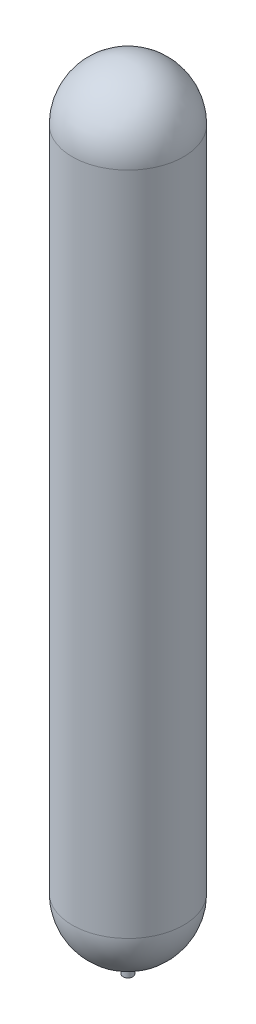
ISO-10303-21;
HEADER;
FILE_DESCRIPTION(('STEP AP214'),'2;1');
FILE_NAME('part.step','',(''),(''),'','','');
FILE_SCHEMA(('AUTOMOTIVE_DESIGN { 1 0 10303 214 1 1 1 1 }'));
ENDSEC;
DATA;
#1=APPLICATION_CONTEXT('core data for automotive mechanical design processes');
#2=APPLICATION_PROTOCOL_DEFINITION('international standard','automotive_design',2000,#1);
#3=PRODUCT_CONTEXT('',#1,'mechanical');
#4=PRODUCT('Part','Part','',(#3));
#5=PRODUCT_RELATED_PRODUCT_CATEGORY('part','',(#4));
#6=PRODUCT_DEFINITION_FORMATION('','',#4);
#7=PRODUCT_DEFINITION_CONTEXT('part definition',#1,'design');
#8=PRODUCT_DEFINITION('design','',#6,#7);
#9=PRODUCT_DEFINITION_SHAPE('','',#8);
#10=(LENGTH_UNIT() NAMED_UNIT(*) SI_UNIT(.MILLI.,.METRE.));
#11=(NAMED_UNIT(*) PLANE_ANGLE_UNIT() SI_UNIT($,.RADIAN.));
#12=(NAMED_UNIT(*) SI_UNIT($,.STERADIAN.) SOLID_ANGLE_UNIT());
#13=UNCERTAINTY_MEASURE_WITH_UNIT(LENGTH_MEASURE(1.E-05),#10,'distance_accuracy_value','');
#14=(GEOMETRIC_REPRESENTATION_CONTEXT(3) GLOBAL_UNCERTAINTY_ASSIGNED_CONTEXT((#13)) GLOBAL_UNIT_ASSIGNED_CONTEXT((#10,
#11,#12)) REPRESENTATION_CONTEXT('',''));
#15=CARTESIAN_POINT('',(0.,0.,0.));
#16=DIRECTION('',(0.,0.,1.));
#17=DIRECTION('',(1.,0.,0.));
#18=AXIS2_PLACEMENT_3D('',#15,#16,#17);
#19=CARTESIAN_POINT('',(0.,50.3580155806544,0.));
#20=DIRECTION('',(0.,1.,0.));
#21=DIRECTION('',(-1.,0.,0.));
#22=AXIS2_PLACEMENT_3D('',#19,#20,#21);
#23=CYLINDRICAL_SURFACE('',#22,144.78);
#24=CARTESIAN_POINT('',(-2.05664977176487E-13,1729.74,0.));
#25=DIRECTION('',(0.,1.,0.));
#26=DIRECTION('',(-1.,0.,0.));
#27=AXIS2_PLACEMENT_3D('',#24,#25,#26);
#28=CIRCLE('',#27,144.78);
#29=CARTESIAN_POINT('',(-144.78,1729.74,0.));
#30=VERTEX_POINT('',#29);
#31=EDGE_CURVE('E69',#30,#30,#28,.T.);
#32=ORIENTED_EDGE('',*,*,#31,.F.);
#33=EDGE_LOOP('',(#32));
#34=FACE_BOUND('',#33,.T.);
#35=CARTESIAN_POINT('',(0.,0.,0.));
#36=DIRECTION('',(0.,1.,0.));
#37=DIRECTION('',(-1.,0.,0.));
#38=AXIS2_PLACEMENT_3D('',#35,#36,#37);
#39=CIRCLE('',#38,144.78);
#40=CARTESIAN_POINT('',(-144.78,0.,0.));
#41=VERTEX_POINT('',#40);
#42=EDGE_CURVE('E11',#41,#41,#39,.T.);
#43=ORIENTED_EDGE('',*,*,#42,.T.);
#44=EDGE_LOOP('',(#43));
#45=FACE_BOUND('',#44,.T.);
#46=ADVANCED_FACE('F47',(#34,#45),#23,.T.);
#47=CARTESIAN_POINT('',(0.,0.,0.));
#48=DIRECTION('',(0.,1.,0.));
#49=DIRECTION('',(-1.,0.,0.));
#50=AXIS2_PLACEMENT_3D('',#47,#48,#49);
#51=SPHERICAL_SURFACE('',#50,144.78);
#52=CARTESIAN_POINT('',(0.,-144.221906796436,0.));
#53=DIRECTION('',(0.,1.,0.));
#54=DIRECTION('',(-1.,0.,0.));
#55=AXIS2_PLACEMENT_3D('',#52,#53,#54);
#56=CIRCLE('',#55,12.7);
#57=CARTESIAN_POINT('',(-12.7,-144.221906796436,0.));
#58=VERTEX_POINT('',#57);
#59=EDGE_CURVE('E53',#58,#58,#56,.T.);
#60=ORIENTED_EDGE('',*,*,#59,.T.);
#61=EDGE_LOOP('',(#60));
#62=FACE_BOUND('',#61,.T.);
#63=ORIENTED_EDGE('',*,*,#42,.F.);
#64=EDGE_LOOP('',(#63));
#65=FACE_BOUND('',#64,.T.);
#66=ADVANCED_FACE('F76',(#62,#65),#51,.T.);
#67=CARTESIAN_POINT('',(0.,50.3580155806544,0.));
#68=DIRECTION('',(0.,1.,0.));
#69=DIRECTION('',(-1.,0.,0.));
#70=AXIS2_PLACEMENT_3D('',#67,#68,#69);
#71=CYLINDRICAL_SURFACE('',#70,12.7);
#72=CARTESIAN_POINT('',(0.,-140.881326110879,0.));
#73=DIRECTION('',(0.,1.,0.));
#74=DIRECTION('',(-1.,0.,0.));
#75=AXIS2_PLACEMENT_3D('',#72,#73,#74);
#76=CIRCLE('',#75,12.7);
#77=CARTESIAN_POINT('',(-12.7,-140.881326110879,0.));
#78=VERTEX_POINT('',#77);
#79=EDGE_CURVE('E57',#78,#78,#76,.T.);
#80=ORIENTED_EDGE('',*,*,#79,.T.);
#81=EDGE_LOOP('',(#80));
#82=FACE_BOUND('',#81,.T.);
#83=ORIENTED_EDGE('',*,*,#59,.F.);
#84=EDGE_LOOP('',(#83));
#85=FACE_BOUND('',#84,.T.);
#86=ADVANCED_FACE('F80',(#82,#85),#71,.F.);
#87=CARTESIAN_POINT('',(0.,0.,0.));
#88=DIRECTION('',(0.,1.,0.));
#89=DIRECTION('',(-1.,0.,0.));
#90=AXIS2_PLACEMENT_3D('',#87,#88,#89);
#91=SPHERICAL_SURFACE('',#90,141.4526);
#92=ORIENTED_EDGE('',*,*,#79,.F.);
#93=EDGE_LOOP('',(#92));
#94=FACE_BOUND('',#93,.T.);
#95=CARTESIAN_POINT('',(0.,0.,0.));
#96=DIRECTION('',(0.,1.,0.));
#97=DIRECTION('',(-1.,0.,0.));
#98=AXIS2_PLACEMENT_3D('',#95,#96,#97);
#99=CIRCLE('',#98,141.4526);
#100=CARTESIAN_POINT('',(-141.4526,0.,0.));
#101=VERTEX_POINT('',#100);
#102=EDGE_CURVE('E61',#101,#101,#99,.T.);
#103=ORIENTED_EDGE('',*,*,#102,.T.);
#104=EDGE_LOOP('',(#103));
#105=FACE_BOUND('',#104,.T.);
#106=ADVANCED_FACE('F84',(#94,#105),#91,.F.);
#107=CARTESIAN_POINT('',(0.,50.3580155806544,0.));
#108=DIRECTION('',(0.,1.,0.));
#109=DIRECTION('',(-1.,0.,0.));
#110=AXIS2_PLACEMENT_3D('',#107,#108,#109);
#111=CYLINDRICAL_SURFACE('',#110,141.4526);
#112=ORIENTED_EDGE('',*,*,#102,.F.);
#113=EDGE_LOOP('',(#112));
#114=FACE_BOUND('',#113,.T.);
#115=CARTESIAN_POINT('',(-2.05664977176487E-13,1729.74,0.));
#116=DIRECTION('',(0.,1.,0.));
#117=DIRECTION('',(-1.,0.,0.));
#118=AXIS2_PLACEMENT_3D('',#115,#116,#117);
#119=CIRCLE('',#118,141.4526);
#120=CARTESIAN_POINT('',(-141.4526,1729.74,0.));
#121=VERTEX_POINT('',#120);
#122=EDGE_CURVE('E66',#121,#121,#119,.T.);
#123=ORIENTED_EDGE('',*,*,#122,.T.);
#124=EDGE_LOOP('',(#123));
#125=FACE_BOUND('',#124,.T.);
#126=ADVANCED_FACE('F91',(#114,#125),#111,.F.);
#127=CARTESIAN_POINT('',(-2.08166817117217E-13,1729.74,0.));
#128=DIRECTION('',(0.,1.,0.));
#129=DIRECTION('',(-1.,0.,0.));
#130=AXIS2_PLACEMENT_3D('',#127,#128,#129);
#131=SPHERICAL_SURFACE('',#130,141.4526);
#132=ORIENTED_EDGE('',*,*,#122,.F.);
#133=EDGE_LOOP('',(#132));
#134=FACE_BOUND('',#133,.T.);
#135=ADVANCED_FACE('F95',(#134),#131,.F.);
#136=CARTESIAN_POINT('',(-2.08166817117217E-13,1729.74,0.));
#137=DIRECTION('',(0.,1.,0.));
#138=DIRECTION('',(-1.,0.,0.));
#139=AXIS2_PLACEMENT_3D('',#136,#137,#138);
#140=SPHERICAL_SURFACE('',#139,144.78);
#141=ORIENTED_EDGE('',*,*,#31,.T.);
#142=EDGE_LOOP('',(#141));
#143=FACE_BOUND('',#142,.T.);
#144=ADVANCED_FACE('F73',(#143),#140,.T.);
#145=CLOSED_SHELL('',(#46,#66,#86,#106,#126,#135,#144));
#146=MANIFOLD_SOLID_BREP('B2',#145);
#147=CARTESIAN_POINT('',(0.,50.3580155806544,0.));
#148=DIRECTION('',(0.,1.,0.));
#149=DIRECTION('',(-1.,0.,0.));
#150=AXIS2_PLACEMENT_3D('',#147,#148,#149);
#151=CYLINDRICAL_SURFACE('',#150,141.4526);
#152=CARTESIAN_POINT('',(0.,0.,0.));
#153=DIRECTION('',(0.,1.,0.));
#154=DIRECTION('',(-1.,0.,0.));
#155=AXIS2_PLACEMENT_3D('',#152,#153,#154);
#156=CIRCLE('',#155,141.4526);
#157=CARTESIAN_POINT('',(-141.4526,0.,0.));
#158=VERTEX_POINT('',#157);
#159=EDGE_CURVE('E46',#158,#158,#156,.T.);
#160=ORIENTED_EDGE('',*,*,#159,.T.);
#161=EDGE_LOOP('',(#160));
#162=FACE_BOUND('',#161,.T.);
#163=CARTESIAN_POINT('',(-2.05664977176487E-13,1729.74,0.));
#164=DIRECTION('',(0.,1.,0.));
#165=DIRECTION('',(-1.,0.,0.));
#166=AXIS2_PLACEMENT_3D('',#163,#164,#165);
#167=CIRCLE('',#166,141.4526);
#168=CARTESIAN_POINT('',(-141.4526,1729.74,0.));
#169=VERTEX_POINT('',#168);
#170=EDGE_CURVE('E176',#169,#169,#167,.T.);
#171=ORIENTED_EDGE('',*,*,#170,.F.);
#172=EDGE_LOOP('',(#171));
#173=FACE_BOUND('',#172,.T.);
#174=ADVANCED_FACE('F148',(#162,#173),#151,.T.);
#175=CARTESIAN_POINT('',(0.,0.,0.));
#176=DIRECTION('',(0.,1.,0.));
#177=DIRECTION('',(-1.,0.,0.));
#178=AXIS2_PLACEMENT_3D('',#175,#176,#177);
#179=SPHERICAL_SURFACE('',#178,141.4526);
#180=CARTESIAN_POINT('',(0.,-140.881326110879,0.));
#181=DIRECTION('',(0.,1.,0.));
#182=DIRECTION('',(-1.,0.,0.));
#183=AXIS2_PLACEMENT_3D('',#180,#181,#182);
#184=CIRCLE('',#183,12.7);
#185=CARTESIAN_POINT('',(-12.7,-140.881326110879,0.));
#186=VERTEX_POINT('',#185);
#187=EDGE_CURVE('E154',#186,#186,#184,.T.);
#188=ORIENTED_EDGE('',*,*,#187,.T.);
#189=EDGE_LOOP('',(#188));
#190=FACE_BOUND('',#189,.T.);
#191=ORIENTED_EDGE('',*,*,#159,.F.);
#192=EDGE_LOOP('',(#191));
#193=FACE_BOUND('',#192,.T.);
#194=ADVANCED_FACE('F183',(#190,#193),#179,.T.);
#195=CARTESIAN_POINT('',(0.,50.3580155806544,0.));
#196=DIRECTION('',(0.,1.,0.));
#197=DIRECTION('',(-1.,0.,0.));
#198=AXIS2_PLACEMENT_3D('',#195,#196,#197);
#199=CYLINDRICAL_SURFACE('',#198,12.7);
#200=ORIENTED_EDGE('',*,*,#187,.F.);
#201=EDGE_LOOP('',(#200));
#202=FACE_BOUND('',#201,.T.);
#203=CARTESIAN_POINT('',(0.,-182.321906796436,0.));
#204=DIRECTION('',(0.,1.,0.));
#205=DIRECTION('',(-1.,0.,0.));
#206=AXIS2_PLACEMENT_3D('',#203,#204,#205);
#207=CIRCLE('',#206,12.7);
#208=CARTESIAN_POINT('',(-12.7,-182.321906796436,0.));
#209=VERTEX_POINT('',#208);
#210=EDGE_CURVE('E158',#209,#209,#207,.T.);
#211=ORIENTED_EDGE('',*,*,#210,.T.);
#212=EDGE_LOOP('',(#211));
#213=FACE_BOUND('',#212,.T.);
#214=ADVANCED_FACE('F187',(#202,#213),#199,.T.);
#215=CARTESIAN_POINT('',(0.,-182.321906796436,0.));
#216=DIRECTION('',(0.,1.,0.));
#217=DIRECTION('',(-1.,0.,0.));
#218=AXIS2_PLACEMENT_3D('',#215,#216,#217);
#219=PLANE('',#218);
#220=ORIENTED_EDGE('',*,*,#210,.F.);
#221=EDGE_LOOP('',(#220));
#222=FACE_BOUND('',#221,.T.);
#223=CARTESIAN_POINT('',(0.,-182.321906796436,0.));
#224=DIRECTION('',(0.,1.,0.));
#225=DIRECTION('',(-1.,0.,0.));
#226=AXIS2_PLACEMENT_3D('',#223,#224,#225);
#227=CIRCLE('',#226,3.175);
#228=CARTESIAN_POINT('',(-3.17499999999997,-182.321906796436,0.));
#229=VERTEX_POINT('',#228);
#230=EDGE_CURVE('E162',#229,#229,#227,.T.);
#231=ORIENTED_EDGE('',*,*,#230,.T.);
#232=EDGE_LOOP('',(#231));
#233=FACE_BOUND('',#232,.T.);
#234=ADVANCED_FACE('F191',(#222,#233),#219,.F.);
#235=CARTESIAN_POINT('',(0.,50.3580155806544,0.));
#236=DIRECTION('',(0.,1.,0.));
#237=DIRECTION('',(-1.,0.,0.));
#238=AXIS2_PLACEMENT_3D('',#235,#236,#237);
#239=CYLINDRICAL_SURFACE('',#238,3.175);
#240=ORIENTED_EDGE('',*,*,#230,.F.);
#241=EDGE_LOOP('',(#240));
#242=FACE_BOUND('',#241,.T.);
#243=CARTESIAN_POINT('',(0.,-114.738679780447,0.));
#244=DIRECTION('',(0.,1.,0.));
#245=DIRECTION('',(-1.,0.,0.));
#246=AXIS2_PLACEMENT_3D('',#243,#244,#245);
#247=CIRCLE('',#246,3.175);
#248=CARTESIAN_POINT('',(-3.17499999999998,-114.738679780447,0.));
#249=VERTEX_POINT('',#248);
#250=EDGE_CURVE('E167',#249,#249,#247,.T.);
#251=ORIENTED_EDGE('',*,*,#250,.T.);
#252=EDGE_LOOP('',(#251));
#253=FACE_BOUND('',#252,.T.);
#254=ADVANCED_FACE('F198',(#242,#253),#239,.F.);
#255=CARTESIAN_POINT('',(0.,0.,0.));
#256=DIRECTION('',(0.,1.,0.));
#257=DIRECTION('',(-1.,0.,0.));
#258=AXIS2_PLACEMENT_3D('',#255,#256,#257);
#259=SPHERICAL_SURFACE('',#258,114.7826);
#260=ORIENTED_EDGE('',*,*,#250,.F.);
#261=EDGE_LOOP('',(#260));
#262=FACE_BOUND('',#261,.T.);
#263=CARTESIAN_POINT('',(0.,0.,0.));
#264=DIRECTION('',(0.,1.,0.));
#265=DIRECTION('',(-1.,0.,0.));
#266=AXIS2_PLACEMENT_3D('',#263,#264,#265);
#267=CIRCLE('',#266,114.7826);
#268=CARTESIAN_POINT('',(-114.7826,0.,0.));
#269=VERTEX_POINT('',#268);
#270=EDGE_CURVE('E170',#269,#269,#267,.T.);
#271=ORIENTED_EDGE('',*,*,#270,.T.);
#272=EDGE_LOOP('',(#271));
#273=FACE_BOUND('',#272,.T.);
#274=ADVANCED_FACE('F202',(#262,#273),#259,.F.);
#275=CARTESIAN_POINT('',(0.,50.3580155806544,0.));
#276=DIRECTION('',(0.,1.,0.));
#277=DIRECTION('',(-1.,0.,0.));
#278=AXIS2_PLACEMENT_3D('',#275,#276,#277);
#279=CYLINDRICAL_SURFACE('',#278,114.7826);
#280=ORIENTED_EDGE('',*,*,#270,.F.);
#281=EDGE_LOOP('',(#280));
#282=FACE_BOUND('',#281,.T.);
#283=CARTESIAN_POINT('',(-2.05664977176487E-13,1729.74,0.));
#284=DIRECTION('',(0.,1.,0.));
#285=DIRECTION('',(-1.,0.,0.));
#286=AXIS2_PLACEMENT_3D('',#283,#284,#285);
#287=CIRCLE('',#286,114.7826);
#288=CARTESIAN_POINT('',(-114.7826,1729.74,0.));
#289=VERTEX_POINT('',#288);
#290=EDGE_CURVE('E173',#289,#289,#287,.T.);
#291=ORIENTED_EDGE('',*,*,#290,.T.);
#292=EDGE_LOOP('',(#291));
#293=FACE_BOUND('',#292,.T.);
#294=ADVANCED_FACE('F206',(#282,#293),#279,.F.);
#295=CARTESIAN_POINT('',(-2.08166817117217E-13,1729.74,0.));
#296=DIRECTION('',(0.,1.,0.));
#297=DIRECTION('',(-1.,0.,0.));
#298=AXIS2_PLACEMENT_3D('',#295,#296,#297);
#299=SPHERICAL_SURFACE('',#298,114.7826);
#300=ORIENTED_EDGE('',*,*,#290,.F.);
#301=EDGE_LOOP('',(#300));
#302=FACE_BOUND('',#301,.T.);
#303=ADVANCED_FACE('F210',(#302),#299,.F.);
#304=CARTESIAN_POINT('',(-2.08166817117217E-13,1729.74,0.));
#305=DIRECTION('',(0.,1.,0.));
#306=DIRECTION('',(-1.,0.,0.));
#307=AXIS2_PLACEMENT_3D('',#304,#305,#306);
#308=SPHERICAL_SURFACE('',#307,141.4526);
#309=ORIENTED_EDGE('',*,*,#170,.T.);
#310=EDGE_LOOP('',(#309));
#311=FACE_BOUND('',#310,.T.);
#312=ADVANCED_FACE('F180',(#311),#308,.T.);
#313=CLOSED_SHELL('',(#174,#194,#214,#234,#254,#274,#294,#303,#312));
#314=MANIFOLD_SOLID_BREP('B6',#313);
#315=ADVANCED_BREP_SHAPE_REPRESENTATION('',(#18,#146,#314),#14);
#316=SHAPE_DEFINITION_REPRESENTATION(#9,#315);
ENDSEC;
END-ISO-10303-21;
